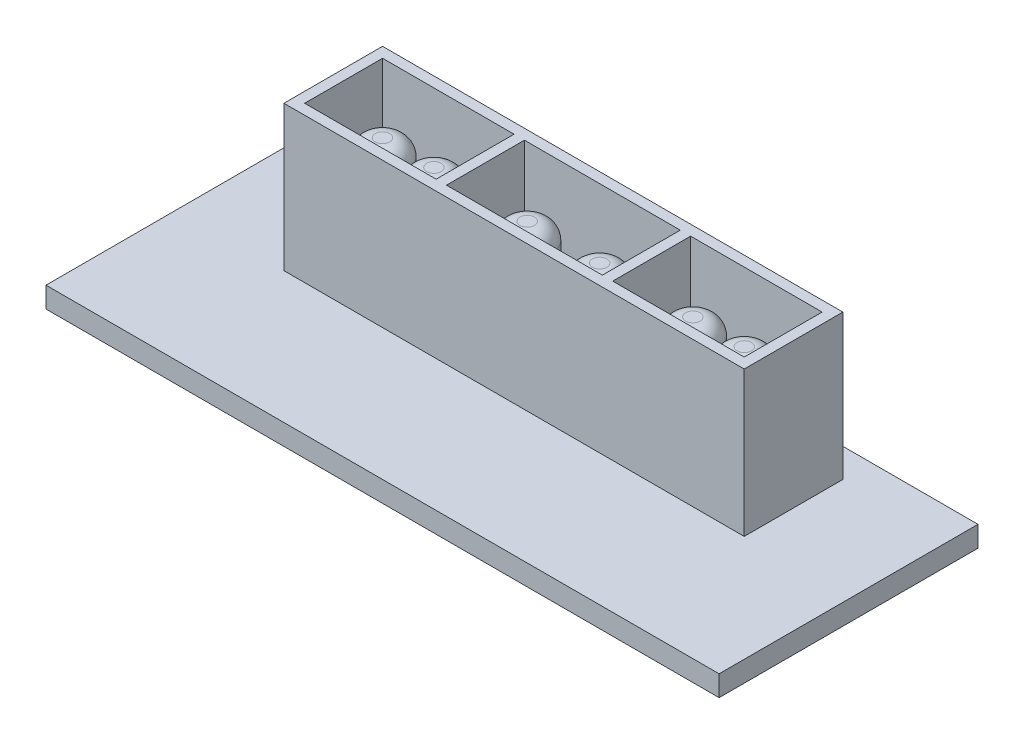
ISO-10303-21;
HEADER;
FILE_DESCRIPTION(('STEP AP214'),'2;1');
FILE_NAME('part.step','',(''),(''),'','','');
FILE_SCHEMA(('AUTOMOTIVE_DESIGN { 1 0 10303 214 1 1 1 1 }'));
ENDSEC;
DATA;
#1=APPLICATION_CONTEXT('core data for automotive mechanical design processes');
#2=APPLICATION_PROTOCOL_DEFINITION('international standard','automotive_design',2000,#1);
#3=PRODUCT_CONTEXT('',#1,'mechanical');
#4=PRODUCT('Part','Part','',(#3));
#5=PRODUCT_RELATED_PRODUCT_CATEGORY('part','',(#4));
#6=PRODUCT_DEFINITION_FORMATION('','',#4);
#7=PRODUCT_DEFINITION_CONTEXT('part definition',#1,'design');
#8=PRODUCT_DEFINITION('design','',#6,#7);
#9=PRODUCT_DEFINITION_SHAPE('','',#8);
#10=(LENGTH_UNIT() NAMED_UNIT(*) SI_UNIT(.MILLI.,.METRE.));
#11=(NAMED_UNIT(*) PLANE_ANGLE_UNIT() SI_UNIT($,.RADIAN.));
#12=(NAMED_UNIT(*) SI_UNIT($,.STERADIAN.) SOLID_ANGLE_UNIT());
#13=UNCERTAINTY_MEASURE_WITH_UNIT(LENGTH_MEASURE(1.E-05),#10,'distance_accuracy_value','');
#14=(GEOMETRIC_REPRESENTATION_CONTEXT(3) GLOBAL_UNCERTAINTY_ASSIGNED_CONTEXT((#13)) GLOBAL_UNIT_ASSIGNED_CONTEXT((#10,
#11,#12)) REPRESENTATION_CONTEXT('',''));
#15=CARTESIAN_POINT('',(0.,0.,0.));
#16=DIRECTION('',(0.,0.,1.));
#17=DIRECTION('',(1.,0.,0.));
#18=AXIS2_PLACEMENT_3D('',#15,#16,#17);
#19=CARTESIAN_POINT('',(0.,2.,0.));
#20=DIRECTION('',(0.,1.,0.));
#21=DIRECTION('',(0.,0.,1.));
#22=AXIS2_PLACEMENT_3D('',#19,#20,#21);
#23=PLANE('',#22);
#24=DIRECTION('',(0.,0.,-1.));
#25=VECTOR('',#24,1.);
#26=CARTESIAN_POINT('',(0.,2.,0.));
#27=LINE('',#26,#25);
#28=CARTESIAN_POINT('',(0.,2.,0.));
#29=VERTEX_POINT('',#28);
#30=CARTESIAN_POINT('',(0.,2.,-25.));
#31=VERTEX_POINT('',#30);
#32=EDGE_CURVE('E302',#29,#31,#27,.T.);
#33=ORIENTED_EDGE('',*,*,#32,.T.);
#34=DIRECTION('',(-1.,0.,0.));
#35=VECTOR('',#34,1.);
#36=CARTESIAN_POINT('',(0.,2.,-25.));
#37=LINE('',#36,#35);
#38=CARTESIAN_POINT('',(-65.,2.,-25.));
#39=VERTEX_POINT('',#38);
#40=EDGE_CURVE('E305',#31,#39,#37,.T.);
#41=ORIENTED_EDGE('',*,*,#40,.T.);
#42=DIRECTION('',(0.,0.,1.));
#43=VECTOR('',#42,1.);
#44=CARTESIAN_POINT('',(-65.,2.,0.));
#45=LINE('',#44,#43);
#46=CARTESIAN_POINT('',(-65.,2.,0.));
#47=VERTEX_POINT('',#46);
#48=EDGE_CURVE('E308',#39,#47,#45,.T.);
#49=ORIENTED_EDGE('',*,*,#48,.T.);
#50=DIRECTION('',(1.,0.,0.));
#51=VECTOR('',#50,1.);
#52=CARTESIAN_POINT('',(0.,2.,0.));
#53=LINE('',#52,#51);
#54=EDGE_CURVE('E310',#47,#29,#53,.T.);
#55=ORIENTED_EDGE('',*,*,#54,.T.);
#56=EDGE_LOOP('',(#33,#41,#49,#55));
#57=FACE_BOUND('',#56,.T.);
#58=DIRECTION('',(1.,0.,0.));
#59=VECTOR('',#58,1.);
#60=CARTESIAN_POINT('',(-54.725,2.,-12.7));
#61=LINE('',#60,#59);
#62=CARTESIAN_POINT('',(-54.725,2.,-12.7));
#63=VERTEX_POINT('',#62);
#64=CARTESIAN_POINT('',(-10.275,2.,-12.7));
#65=VERTEX_POINT('',#64);
#66=EDGE_CURVE('E288',#63,#65,#61,.T.);
#67=ORIENTED_EDGE('',*,*,#66,.F.);
#68=DIRECTION('',(0.,0.,1.));
#69=VECTOR('',#68,1.);
#70=CARTESIAN_POINT('',(-54.725,2.,-22.225));
#71=LINE('',#70,#69);
#72=CARTESIAN_POINT('',(-54.725,2.,-22.225));
#73=VERTEX_POINT('',#72);
#74=EDGE_CURVE('E274',#73,#63,#71,.T.);
#75=ORIENTED_EDGE('',*,*,#74,.F.);
#76=DIRECTION('',(-1.,0.,0.));
#77=VECTOR('',#76,1.);
#78=CARTESIAN_POINT('',(-54.725,2.,-22.225));
#79=LINE('',#78,#77);
#80=CARTESIAN_POINT('',(-10.275,2.,-22.225));
#81=VERTEX_POINT('',#80);
#82=EDGE_CURVE('E279',#81,#73,#79,.T.);
#83=ORIENTED_EDGE('',*,*,#82,.F.);
#84=DIRECTION('',(0.,0.,-1.));
#85=VECTOR('',#84,1.);
#86=CARTESIAN_POINT('',(-10.275,2.,-22.225));
#87=LINE('',#86,#85);
#88=EDGE_CURVE('E290',#65,#81,#87,.T.);
#89=ORIENTED_EDGE('',*,*,#88,.F.);
#90=EDGE_LOOP('',(#67,#75,#83,#89));
#91=FACE_BOUND('',#90,.T.);
#92=ADVANCED_FACE('F35',(#57,#91),#23,.T.);
#93=CARTESIAN_POINT('',(0.,2.,0.));
#94=DIRECTION('',(-1.,0.,0.));
#95=DIRECTION('',(0.,0.,1.));
#96=AXIS2_PLACEMENT_3D('',#93,#94,#95);
#97=PLANE('',#96);
#98=DIRECTION('',(0.,0.,-1.));
#99=VECTOR('',#98,1.);
#100=CARTESIAN_POINT('',(0.,0.,0.));
#101=LINE('',#100,#99);
#102=CARTESIAN_POINT('',(0.,0.,0.));
#103=VERTEX_POINT('',#102);
#104=CARTESIAN_POINT('',(0.,0.,-25.));
#105=VERTEX_POINT('',#104);
#106=EDGE_CURVE('E301',#103,#105,#101,.T.);
#107=ORIENTED_EDGE('',*,*,#106,.T.);
#108=DIRECTION('',(0.,-1.,0.));
#109=VECTOR('',#108,1.);
#110=CARTESIAN_POINT('',(0.,2.,-25.));
#111=LINE('',#110,#109);
#112=EDGE_CURVE('E328',#31,#105,#111,.T.);
#113=ORIENTED_EDGE('',*,*,#112,.F.);
#114=ORIENTED_EDGE('',*,*,#32,.F.);
#115=DIRECTION('',(0.,-1.,0.));
#116=VECTOR('',#115,1.);
#117=CARTESIAN_POINT('',(0.,2.,0.));
#118=LINE('',#117,#116);
#119=EDGE_CURVE('E312',#29,#103,#118,.T.);
#120=ORIENTED_EDGE('',*,*,#119,.T.);
#121=EDGE_LOOP('',(#107,#113,#114,#120));
#122=FACE_BOUND('',#121,.T.);
#123=ADVANCED_FACE('F375',(#122),#97,.F.);
#124=CARTESIAN_POINT('',(0.,2.,-25.));
#125=DIRECTION('',(0.,0.,1.));
#126=DIRECTION('',(1.,0.,0.));
#127=AXIS2_PLACEMENT_3D('',#124,#125,#126);
#128=PLANE('',#127);
#129=DIRECTION('',(-1.,0.,0.));
#130=VECTOR('',#129,1.);
#131=CARTESIAN_POINT('',(0.,0.,-25.));
#132=LINE('',#131,#130);
#133=CARTESIAN_POINT('',(-65.,0.,-25.));
#134=VERTEX_POINT('',#133);
#135=EDGE_CURVE('E315',#105,#134,#132,.T.);
#136=ORIENTED_EDGE('',*,*,#135,.T.);
#137=DIRECTION('',(0.,-1.,0.));
#138=VECTOR('',#137,1.);
#139=CARTESIAN_POINT('',(-65.,2.,-25.));
#140=LINE('',#139,#138);
#141=EDGE_CURVE('E325',#39,#134,#140,.T.);
#142=ORIENTED_EDGE('',*,*,#141,.F.);
#143=ORIENTED_EDGE('',*,*,#40,.F.);
#144=ORIENTED_EDGE('',*,*,#112,.T.);
#145=EDGE_LOOP('',(#136,#142,#143,#144));
#146=FACE_BOUND('',#145,.T.);
#147=ADVANCED_FACE('F383',(#146),#128,.F.);
#148=CARTESIAN_POINT('',(-65.,2.,0.));
#149=DIRECTION('',(1.,0.,0.));
#150=DIRECTION('',(0.,0.,-1.));
#151=AXIS2_PLACEMENT_3D('',#148,#149,#150);
#152=PLANE('',#151);
#153=DIRECTION('',(0.,0.,1.));
#154=VECTOR('',#153,1.);
#155=CARTESIAN_POINT('',(-65.,0.,0.));
#156=LINE('',#155,#154);
#157=CARTESIAN_POINT('',(-65.,0.,0.));
#158=VERTEX_POINT('',#157);
#159=EDGE_CURVE('E317',#134,#158,#156,.T.);
#160=ORIENTED_EDGE('',*,*,#159,.T.);
#161=DIRECTION('',(0.,-1.,0.));
#162=VECTOR('',#161,1.);
#163=CARTESIAN_POINT('',(-65.,2.,0.));
#164=LINE('',#163,#162);
#165=EDGE_CURVE('E322',#47,#158,#164,.T.);
#166=ORIENTED_EDGE('',*,*,#165,.F.);
#167=ORIENTED_EDGE('',*,*,#48,.F.);
#168=ORIENTED_EDGE('',*,*,#141,.T.);
#169=EDGE_LOOP('',(#160,#166,#167,#168));
#170=FACE_BOUND('',#169,.T.);
#171=ADVANCED_FACE('F807',(#170),#152,.F.);
#172=CARTESIAN_POINT('',(0.,2.,0.));
#173=DIRECTION('',(0.,0.,-1.));
#174=DIRECTION('',(-1.,0.,0.));
#175=AXIS2_PLACEMENT_3D('',#172,#173,#174);
#176=PLANE('',#175);
#177=DIRECTION('',(1.,0.,0.));
#178=VECTOR('',#177,1.);
#179=CARTESIAN_POINT('',(0.,0.,0.));
#180=LINE('',#179,#178);
#181=EDGE_CURVE('E306',#158,#103,#180,.T.);
#182=ORIENTED_EDGE('',*,*,#181,.T.);
#183=ORIENTED_EDGE('',*,*,#119,.F.);
#184=ORIENTED_EDGE('',*,*,#54,.F.);
#185=ORIENTED_EDGE('',*,*,#165,.T.);
#186=EDGE_LOOP('',(#182,#183,#184,#185));
#187=FACE_BOUND('',#186,.T.);
#188=ADVANCED_FACE('F811',(#187),#176,.F.);
#189=CARTESIAN_POINT('',(0.,0.,0.));
#190=DIRECTION('',(0.,1.,0.));
#191=DIRECTION('',(0.,0.,1.));
#192=AXIS2_PLACEMENT_3D('',#189,#190,#191);
#193=PLANE('',#192);
#194=ORIENTED_EDGE('',*,*,#106,.F.);
#195=ORIENTED_EDGE('',*,*,#181,.F.);
#196=ORIENTED_EDGE('',*,*,#159,.F.);
#197=ORIENTED_EDGE('',*,*,#135,.F.);
#198=EDGE_LOOP('',(#194,#195,#196,#197));
#199=FACE_BOUND('',#198,.T.);
#200=ADVANCED_FACE('F460',(#199),#193,.F.);
#201=CARTESIAN_POINT('',(0.,16.,0.));
#202=DIRECTION('',(0.,1.,0.));
#203=DIRECTION('',(0.,0.,1.));
#204=AXIS2_PLACEMENT_3D('',#201,#202,#203);
#205=PLANE('',#204);
#206=DIRECTION('',(0.,0.,1.));
#207=VECTOR('',#206,1.);
#208=CARTESIAN_POINT('',(-54.725,16.,-22.225));
#209=LINE('',#208,#207);
#210=CARTESIAN_POINT('',(-54.725,16.,-22.225));
#211=VERTEX_POINT('',#210);
#212=CARTESIAN_POINT('',(-54.725,16.,-12.7));
#213=VERTEX_POINT('',#212);
#214=EDGE_CURVE('E275',#211,#213,#209,.T.);
#215=ORIENTED_EDGE('',*,*,#214,.T.);
#216=DIRECTION('',(1.,0.,0.));
#217=VECTOR('',#216,1.);
#218=CARTESIAN_POINT('',(-54.725,16.,-12.7));
#219=LINE('',#218,#217);
#220=CARTESIAN_POINT('',(-10.275,16.,-12.7));
#221=VERTEX_POINT('',#220);
#222=EDGE_CURVE('E278',#213,#221,#219,.T.);
#223=ORIENTED_EDGE('',*,*,#222,.T.);
#224=DIRECTION('',(0.,0.,-1.));
#225=VECTOR('',#224,1.);
#226=CARTESIAN_POINT('',(-10.275,16.,-22.225));
#227=LINE('',#226,#225);
#228=CARTESIAN_POINT('',(-10.275,16.,-22.225));
#229=VERTEX_POINT('',#228);
#230=EDGE_CURVE('E281',#221,#229,#227,.T.);
#231=ORIENTED_EDGE('',*,*,#230,.T.);
#232=DIRECTION('',(-1.,0.,0.));
#233=VECTOR('',#232,1.);
#234=CARTESIAN_POINT('',(-54.725,16.,-22.225));
#235=LINE('',#234,#233);
#236=EDGE_CURVE('E283',#229,#211,#235,.T.);
#237=ORIENTED_EDGE('',*,*,#236,.T.);
#238=EDGE_LOOP('',(#215,#223,#231,#237));
#239=FACE_BOUND('',#238,.T.);
#240=DIRECTION('',(1.,0.,0.));
#241=VECTOR('',#240,1.);
#242=CARTESIAN_POINT('',(-53.725,16.,-13.7));
#243=LINE('',#242,#241);
#244=CARTESIAN_POINT('',(-53.725,16.,-13.7));
#245=VERTEX_POINT('',#244);
#246=CARTESIAN_POINT('',(-41.025,16.,-13.7));
#247=VERTEX_POINT('',#246);
#248=EDGE_CURVE('E248',#245,#247,#243,.T.);
#249=ORIENTED_EDGE('',*,*,#248,.F.);
#250=DIRECTION('',(0.,0.,1.));
#251=VECTOR('',#250,1.);
#252=CARTESIAN_POINT('',(-53.725,16.,-21.225));
#253=LINE('',#252,#251);
#254=CARTESIAN_POINT('',(-53.725,16.,-21.225));
#255=VERTEX_POINT('',#254);
#256=EDGE_CURVE('E246',#255,#245,#253,.T.);
#257=ORIENTED_EDGE('',*,*,#256,.F.);
#258=DIRECTION('',(-1.,0.,0.));
#259=VECTOR('',#258,1.);
#260=CARTESIAN_POINT('',(-53.725,16.,-21.225));
#261=LINE('',#260,#259);
#262=CARTESIAN_POINT('',(-41.025,16.,-21.225));
#263=VERTEX_POINT('',#262);
#264=EDGE_CURVE('E254',#263,#255,#261,.T.);
#265=ORIENTED_EDGE('',*,*,#264,.F.);
#266=DIRECTION('',(0.,0.,-1.));
#267=VECTOR('',#266,1.);
#268=CARTESIAN_POINT('',(-41.025,16.,-21.225));
#269=LINE('',#268,#267);
#270=EDGE_CURVE('E251',#247,#263,#269,.T.);
#271=ORIENTED_EDGE('',*,*,#270,.F.);
#272=EDGE_LOOP('',(#249,#257,#265,#271));
#273=FACE_BOUND('',#272,.T.);
#274=DIRECTION('',(0.,0.,1.));
#275=VECTOR('',#274,1.);
#276=CARTESIAN_POINT('',(-23.975,16.,-21.225));
#277=LINE('',#276,#275);
#278=CARTESIAN_POINT('',(-23.975,16.,-21.225));
#279=VERTEX_POINT('',#278);
#280=CARTESIAN_POINT('',(-23.975,16.,-13.7));
#281=VERTEX_POINT('',#280);
#282=EDGE_CURVE('E220',#279,#281,#277,.T.);
#283=ORIENTED_EDGE('',*,*,#282,.F.);
#284=DIRECTION('',(-1.,0.,0.));
#285=VECTOR('',#284,1.);
#286=CARTESIAN_POINT('',(-23.975,16.,-21.225));
#287=LINE('',#286,#285);
#288=CARTESIAN_POINT('',(-11.275,16.,-21.225));
#289=VERTEX_POINT('',#288);
#290=EDGE_CURVE('E218',#289,#279,#287,.T.);
#291=ORIENTED_EDGE('',*,*,#290,.F.);
#292=DIRECTION('',(0.,0.,-1.));
#293=VECTOR('',#292,1.);
#294=CARTESIAN_POINT('',(-11.275,16.,-21.225));
#295=LINE('',#294,#293);
#296=CARTESIAN_POINT('',(-11.275,16.,-13.7));
#297=VERTEX_POINT('',#296);
#298=EDGE_CURVE('E226',#297,#289,#295,.T.);
#299=ORIENTED_EDGE('',*,*,#298,.F.);
#300=DIRECTION('',(1.,0.,0.));
#301=VECTOR('',#300,1.);
#302=CARTESIAN_POINT('',(-23.975,16.,-13.7));
#303=LINE('',#302,#301);
#304=EDGE_CURVE('E223',#281,#297,#303,.T.);
#305=ORIENTED_EDGE('',*,*,#304,.F.);
#306=EDGE_LOOP('',(#283,#291,#299,#305));
#307=FACE_BOUND('',#306,.T.);
#308=DIRECTION('',(0.,0.,-1.));
#309=VECTOR('',#308,1.);
#310=CARTESIAN_POINT('',(-24.975000032,16.,-21.225));
#311=LINE('',#310,#309);
#312=CARTESIAN_POINT('',(-24.975000032,16.,-13.7));
#313=VERTEX_POINT('',#312);
#314=CARTESIAN_POINT('',(-24.975000032,16.,-21.225));
#315=VERTEX_POINT('',#314);
#316=EDGE_CURVE('E184',#313,#315,#311,.T.);
#317=ORIENTED_EDGE('',*,*,#316,.F.);
#318=DIRECTION('',(1.,0.,0.));
#319=VECTOR('',#318,1.);
#320=CARTESIAN_POINT('',(-40.024999968,16.,-13.7));
#321=LINE('',#320,#319);
#322=CARTESIAN_POINT('',(-40.024999968,16.,-13.7));
#323=VERTEX_POINT('',#322);
#324=EDGE_CURVE('E174',#323,#313,#321,.T.);
#325=ORIENTED_EDGE('',*,*,#324,.F.);
#326=DIRECTION('',(0.,0.,1.));
#327=VECTOR('',#326,1.);
#328=CARTESIAN_POINT('',(-40.024999968,16.,-21.225));
#329=LINE('',#328,#327);
#330=CARTESIAN_POINT('',(-40.024999968,16.,-21.225));
#331=VERTEX_POINT('',#330);
#332=EDGE_CURVE('E201',#331,#323,#329,.T.);
#333=ORIENTED_EDGE('',*,*,#332,.F.);
#334=DIRECTION('',(-1.,0.,0.));
#335=VECTOR('',#334,1.);
#336=CARTESIAN_POINT('',(-40.024999968,16.,-21.225));
#337=LINE('',#336,#335);
#338=EDGE_CURVE('E199',#315,#331,#337,.T.);
#339=ORIENTED_EDGE('',*,*,#338,.F.);
#340=EDGE_LOOP('',(#317,#325,#333,#339));
#341=FACE_BOUND('',#340,.T.);
#342=ADVANCED_FACE('F197',(#239,#273,#307,#341),#205,.T.);
#343=CARTESIAN_POINT('',(-54.725,16.,-22.225));
#344=DIRECTION('',(1.,0.,0.));
#345=DIRECTION('',(0.,0.,-1.));
#346=AXIS2_PLACEMENT_3D('',#343,#344,#345);
#347=PLANE('',#346);
#348=ORIENTED_EDGE('',*,*,#74,.T.);
#349=DIRECTION('',(0.,-1.,0.));
#350=VECTOR('',#349,1.);
#351=CARTESIAN_POINT('',(-54.725,16.,-12.7));
#352=LINE('',#351,#350);
#353=EDGE_CURVE('E299',#213,#63,#352,.T.);
#354=ORIENTED_EDGE('',*,*,#353,.F.);
#355=ORIENTED_EDGE('',*,*,#214,.F.);
#356=DIRECTION('',(0.,-1.,0.));
#357=VECTOR('',#356,1.);
#358=CARTESIAN_POINT('',(-54.725,16.,-22.225));
#359=LINE('',#358,#357);
#360=EDGE_CURVE('E285',#211,#73,#359,.T.);
#361=ORIENTED_EDGE('',*,*,#360,.T.);
#362=EDGE_LOOP('',(#348,#354,#355,#361));
#363=FACE_BOUND('',#362,.T.);
#364=ADVANCED_FACE('F459',(#363),#347,.F.);
#365=CARTESIAN_POINT('',(-54.725,16.,-12.7));
#366=DIRECTION('',(0.,0.,-1.));
#367=DIRECTION('',(-1.,0.,0.));
#368=AXIS2_PLACEMENT_3D('',#365,#366,#367);
#369=PLANE('',#368);
#370=ORIENTED_EDGE('',*,*,#66,.T.);
#371=DIRECTION('',(0.,-1.,0.));
#372=VECTOR('',#371,1.);
#373=CARTESIAN_POINT('',(-10.275,16.,-12.7));
#374=LINE('',#373,#372);
#375=EDGE_CURVE('E296',#221,#65,#374,.T.);
#376=ORIENTED_EDGE('',*,*,#375,.F.);
#377=ORIENTED_EDGE('',*,*,#222,.F.);
#378=ORIENTED_EDGE('',*,*,#353,.T.);
#379=EDGE_LOOP('',(#370,#376,#377,#378));
#380=FACE_BOUND('',#379,.T.);
#381=ADVANCED_FACE('F467',(#380),#369,.F.);
#382=CARTESIAN_POINT('',(-10.275,16.,-22.225));
#383=DIRECTION('',(-1.,0.,0.));
#384=DIRECTION('',(0.,0.,1.));
#385=AXIS2_PLACEMENT_3D('',#382,#383,#384);
#386=PLANE('',#385);
#387=ORIENTED_EDGE('',*,*,#88,.T.);
#388=DIRECTION('',(0.,-1.,0.));
#389=VECTOR('',#388,1.);
#390=CARTESIAN_POINT('',(-10.275,16.,-22.225));
#391=LINE('',#390,#389);
#392=EDGE_CURVE('E50',#229,#81,#391,.T.);
#393=ORIENTED_EDGE('',*,*,#392,.F.);
#394=ORIENTED_EDGE('',*,*,#230,.F.);
#395=ORIENTED_EDGE('',*,*,#375,.T.);
#396=EDGE_LOOP('',(#387,#393,#394,#395));
#397=FACE_BOUND('',#396,.T.);
#398=ADVANCED_FACE('F464',(#397),#386,.F.);
#399=CARTESIAN_POINT('',(-54.725,16.,-22.225));
#400=DIRECTION('',(0.,0.,1.));
#401=DIRECTION('',(1.,0.,0.));
#402=AXIS2_PLACEMENT_3D('',#399,#400,#401);
#403=PLANE('',#402);
#404=ORIENTED_EDGE('',*,*,#82,.T.);
#405=ORIENTED_EDGE('',*,*,#360,.F.);
#406=ORIENTED_EDGE('',*,*,#236,.F.);
#407=ORIENTED_EDGE('',*,*,#392,.T.);
#408=EDGE_LOOP('',(#404,#405,#406,#407));
#409=FACE_BOUND('',#408,.T.);
#410=ADVANCED_FACE('F455',(#409),#403,.F.);
#411=CARTESIAN_POINT('',(-53.725,16.,-21.225));
#412=DIRECTION('',(1.,0.,0.));
#413=DIRECTION('',(0.,0.,-1.));
#414=AXIS2_PLACEMENT_3D('',#411,#412,#413);
#415=PLANE('',#414);
#416=DIRECTION('',(0.,0.,1.));
#417=VECTOR('',#416,1.);
#418=CARTESIAN_POINT('',(-53.725,2.,-21.225));
#419=LINE('',#418,#417);
#420=CARTESIAN_POINT('',(-53.725,2.,-21.225));
#421=VERTEX_POINT('',#420);
#422=CARTESIAN_POINT('',(-53.725,2.,-13.7));
#423=VERTEX_POINT('',#422);
#424=EDGE_CURVE('E58',#421,#423,#419,.T.);
#425=ORIENTED_EDGE('',*,*,#424,.F.);
#426=DIRECTION('',(0.,-1.,0.));
#427=VECTOR('',#426,1.);
#428=CARTESIAN_POINT('',(-53.725,16.,-21.225));
#429=LINE('',#428,#427);
#430=EDGE_CURVE('E256',#255,#421,#429,.T.);
#431=ORIENTED_EDGE('',*,*,#430,.F.);
#432=ORIENTED_EDGE('',*,*,#256,.T.);
#433=DIRECTION('',(0.,-1.,0.));
#434=VECTOR('',#433,1.);
#435=CARTESIAN_POINT('',(-53.725,16.,-13.7));
#436=LINE('',#435,#434);
#437=EDGE_CURVE('E271',#245,#423,#436,.T.);
#438=ORIENTED_EDGE('',*,*,#437,.T.);
#439=EDGE_LOOP('',(#425,#431,#432,#438));
#440=FACE_BOUND('',#439,.T.);
#441=ADVANCED_FACE('F451',(#440),#415,.T.);
#442=CARTESIAN_POINT('',(-53.725,16.,-13.7));
#443=DIRECTION('',(0.,0.,-1.));
#444=DIRECTION('',(-1.,0.,0.));
#445=AXIS2_PLACEMENT_3D('',#442,#443,#444);
#446=PLANE('',#445);
#447=DIRECTION('',(1.,0.,0.));
#448=VECTOR('',#447,1.);
#449=CARTESIAN_POINT('',(-53.725,2.,-13.7));
#450=LINE('',#449,#448);
#451=CARTESIAN_POINT('',(-41.025,2.,-13.7));
#452=VERTEX_POINT('',#451);
#453=EDGE_CURVE('E258',#423,#452,#450,.T.);
#454=ORIENTED_EDGE('',*,*,#453,.F.);
#455=ORIENTED_EDGE('',*,*,#437,.F.);
#456=ORIENTED_EDGE('',*,*,#248,.T.);
#457=DIRECTION('',(0.,-1.,0.));
#458=VECTOR('',#457,1.);
#459=CARTESIAN_POINT('',(-41.025,16.,-13.7));
#460=LINE('',#459,#458);
#461=EDGE_CURVE('E268',#247,#452,#460,.T.);
#462=ORIENTED_EDGE('',*,*,#461,.T.);
#463=EDGE_LOOP('',(#454,#455,#456,#462));
#464=FACE_BOUND('',#463,.T.);
#465=ADVANCED_FACE('F447',(#464),#446,.T.);
#466=CARTESIAN_POINT('',(-41.025,16.,-21.225));
#467=DIRECTION('',(-1.,0.,0.));
#468=DIRECTION('',(0.,0.,1.));
#469=AXIS2_PLACEMENT_3D('',#466,#467,#468);
#470=PLANE('',#469);
#471=DIRECTION('',(0.,0.,-1.));
#472=VECTOR('',#471,1.);
#473=CARTESIAN_POINT('',(-41.025,2.,-21.225));
#474=LINE('',#473,#472);
#475=CARTESIAN_POINT('',(-41.025,2.,-21.225));
#476=VERTEX_POINT('',#475);
#477=EDGE_CURVE('E260',#452,#476,#474,.T.);
#478=ORIENTED_EDGE('',*,*,#477,.F.);
#479=ORIENTED_EDGE('',*,*,#461,.F.);
#480=ORIENTED_EDGE('',*,*,#270,.T.);
#481=DIRECTION('',(0.,-1.,0.));
#482=VECTOR('',#481,1.);
#483=CARTESIAN_POINT('',(-41.025,16.,-21.225));
#484=LINE('',#483,#482);
#485=EDGE_CURVE('E265',#263,#476,#484,.T.);
#486=ORIENTED_EDGE('',*,*,#485,.T.);
#487=EDGE_LOOP('',(#478,#479,#480,#486));
#488=FACE_BOUND('',#487,.T.);
#489=ADVANCED_FACE('F443',(#488),#470,.T.);
#490=CARTESIAN_POINT('',(-53.725,16.,-21.225));
#491=DIRECTION('',(0.,0.,1.));
#492=DIRECTION('',(1.,0.,0.));
#493=AXIS2_PLACEMENT_3D('',#490,#491,#492);
#494=PLANE('',#493);
#495=DIRECTION('',(-1.,0.,0.));
#496=VECTOR('',#495,1.);
#497=CARTESIAN_POINT('',(-53.725,2.,-21.225));
#498=LINE('',#497,#496);
#499=EDGE_CURVE('E249',#476,#421,#498,.T.);
#500=ORIENTED_EDGE('',*,*,#499,.F.);
#501=ORIENTED_EDGE('',*,*,#485,.F.);
#502=ORIENTED_EDGE('',*,*,#264,.T.);
#503=ORIENTED_EDGE('',*,*,#430,.T.);
#504=EDGE_LOOP('',(#500,#501,#502,#503));
#505=FACE_BOUND('',#504,.T.);
#506=ADVANCED_FACE('F439',(#505),#494,.T.);
#507=CARTESIAN_POINT('',(-23.975,16.,-21.225));
#508=DIRECTION('',(0.,0.,1.));
#509=DIRECTION('',(1.,0.,0.));
#510=AXIS2_PLACEMENT_3D('',#507,#508,#509);
#511=PLANE('',#510);
#512=DIRECTION('',(-1.,0.,0.));
#513=VECTOR('',#512,1.);
#514=CARTESIAN_POINT('',(-23.975,2.,-21.225));
#515=LINE('',#514,#513);
#516=CARTESIAN_POINT('',(-11.275,2.,-21.225));
#517=VERTEX_POINT('',#516);
#518=CARTESIAN_POINT('',(-23.975,2.,-21.225));
#519=VERTEX_POINT('',#518);
#520=EDGE_CURVE('E193',#517,#519,#515,.T.);
#521=ORIENTED_EDGE('',*,*,#520,.F.);
#522=DIRECTION('',(0.,-1.,0.));
#523=VECTOR('',#522,1.);
#524=CARTESIAN_POINT('',(-11.275,16.,-21.225));
#525=LINE('',#524,#523);
#526=EDGE_CURVE('E228',#289,#517,#525,.T.);
#527=ORIENTED_EDGE('',*,*,#526,.F.);
#528=ORIENTED_EDGE('',*,*,#290,.T.);
#529=DIRECTION('',(0.,-1.,0.));
#530=VECTOR('',#529,1.);
#531=CARTESIAN_POINT('',(-23.975,16.,-21.225));
#532=LINE('',#531,#530);
#533=EDGE_CURVE('E243',#279,#519,#532,.T.);
#534=ORIENTED_EDGE('',*,*,#533,.T.);
#535=EDGE_LOOP('',(#521,#527,#528,#534));
#536=FACE_BOUND('',#535,.T.);
#537=ADVANCED_FACE('F435',(#536),#511,.T.);
#538=CARTESIAN_POINT('',(-23.975,16.,-21.225));
#539=DIRECTION('',(1.,0.,0.));
#540=DIRECTION('',(0.,0.,-1.));
#541=AXIS2_PLACEMENT_3D('',#538,#539,#540);
#542=PLANE('',#541);
#543=DIRECTION('',(0.,0.,1.));
#544=VECTOR('',#543,1.);
#545=CARTESIAN_POINT('',(-23.975,2.,-21.225));
#546=LINE('',#545,#544);
#547=CARTESIAN_POINT('',(-23.975,2.,-13.7));
#548=VERTEX_POINT('',#547);
#549=EDGE_CURVE('E230',#519,#548,#546,.T.);
#550=ORIENTED_EDGE('',*,*,#549,.F.);
#551=ORIENTED_EDGE('',*,*,#533,.F.);
#552=ORIENTED_EDGE('',*,*,#282,.T.);
#553=DIRECTION('',(0.,-1.,0.));
#554=VECTOR('',#553,1.);
#555=CARTESIAN_POINT('',(-23.975,16.,-13.7));
#556=LINE('',#555,#554);
#557=EDGE_CURVE('E240',#281,#548,#556,.T.);
#558=ORIENTED_EDGE('',*,*,#557,.T.);
#559=EDGE_LOOP('',(#550,#551,#552,#558));
#560=FACE_BOUND('',#559,.T.);
#561=ADVANCED_FACE('F431',(#560),#542,.T.);
#562=CARTESIAN_POINT('',(-23.975,16.,-13.7));
#563=DIRECTION('',(0.,0.,-1.));
#564=DIRECTION('',(-1.,0.,0.));
#565=AXIS2_PLACEMENT_3D('',#562,#563,#564);
#566=PLANE('',#565);
#567=DIRECTION('',(1.,0.,0.));
#568=VECTOR('',#567,1.);
#569=CARTESIAN_POINT('',(-23.975,2.,-13.7));
#570=LINE('',#569,#568);
#571=CARTESIAN_POINT('',(-11.275,2.,-13.7));
#572=VERTEX_POINT('',#571);
#573=EDGE_CURVE('E232',#548,#572,#570,.T.);
#574=ORIENTED_EDGE('',*,*,#573,.F.);
#575=ORIENTED_EDGE('',*,*,#557,.F.);
#576=ORIENTED_EDGE('',*,*,#304,.T.);
#577=DIRECTION('',(0.,-1.,0.));
#578=VECTOR('',#577,1.);
#579=CARTESIAN_POINT('',(-11.275,16.,-13.7));
#580=LINE('',#579,#578);
#581=EDGE_CURVE('E237',#297,#572,#580,.T.);
#582=ORIENTED_EDGE('',*,*,#581,.T.);
#583=EDGE_LOOP('',(#574,#575,#576,#582));
#584=FACE_BOUND('',#583,.T.);
#585=ADVANCED_FACE('F427',(#584),#566,.T.);
#586=CARTESIAN_POINT('',(-11.275,16.,-21.225));
#587=DIRECTION('',(-1.,0.,0.));
#588=DIRECTION('',(0.,0.,1.));
#589=AXIS2_PLACEMENT_3D('',#586,#587,#588);
#590=PLANE('',#589);
#591=DIRECTION('',(0.,0.,-1.));
#592=VECTOR('',#591,1.);
#593=CARTESIAN_POINT('',(-11.275,2.,-21.225));
#594=LINE('',#593,#592);
#595=EDGE_CURVE('E221',#572,#517,#594,.T.);
#596=ORIENTED_EDGE('',*,*,#595,.F.);
#597=ORIENTED_EDGE('',*,*,#581,.F.);
#598=ORIENTED_EDGE('',*,*,#298,.T.);
#599=ORIENTED_EDGE('',*,*,#526,.T.);
#600=EDGE_LOOP('',(#596,#597,#598,#599));
#601=FACE_BOUND('',#600,.T.);
#602=ADVANCED_FACE('F424',(#601),#590,.T.);
#603=CARTESIAN_POINT('',(-40.024999968,16.,-13.7));
#604=DIRECTION('',(0.,0.,-1.));
#605=DIRECTION('',(-1.,0.,0.));
#606=AXIS2_PLACEMENT_3D('',#603,#604,#605);
#607=PLANE('',#606);
#608=DIRECTION('',(1.,0.,0.));
#609=VECTOR('',#608,1.);
#610=CARTESIAN_POINT('',(-40.024999968,2.,-13.7));
#611=LINE('',#610,#609);
#612=CARTESIAN_POINT('',(-40.024999968,2.,-13.7));
#613=VERTEX_POINT('',#612);
#614=CARTESIAN_POINT('',(-24.975000032,2.,-13.7));
#615=VERTEX_POINT('',#614);
#616=EDGE_CURVE('E206',#613,#615,#611,.T.);
#617=ORIENTED_EDGE('',*,*,#616,.F.);
#618=DIRECTION('',(0.,-1.,0.));
#619=VECTOR('',#618,1.);
#620=CARTESIAN_POINT('',(-40.024999968,16.,-13.7));
#621=LINE('',#620,#619);
#622=EDGE_CURVE('E180',#323,#613,#621,.T.);
#623=ORIENTED_EDGE('',*,*,#622,.F.);
#624=ORIENTED_EDGE('',*,*,#324,.T.);
#625=DIRECTION('',(0.,-1.,0.));
#626=VECTOR('',#625,1.);
#627=CARTESIAN_POINT('',(-24.975000032,16.,-13.7));
#628=LINE('',#627,#626);
#629=EDGE_CURVE('E178',#313,#615,#628,.T.);
#630=ORIENTED_EDGE('',*,*,#629,.T.);
#631=EDGE_LOOP('',(#617,#623,#624,#630));
#632=FACE_BOUND('',#631,.T.);
#633=ADVANCED_FACE('F177',(#632),#607,.T.);
#634=CARTESIAN_POINT('',(-24.975000032,16.,-21.225));
#635=DIRECTION('',(-1.,0.,0.));
#636=DIRECTION('',(0.,0.,1.));
#637=AXIS2_PLACEMENT_3D('',#634,#635,#636);
#638=PLANE('',#637);
#639=DIRECTION('',(0.,0.,-1.));
#640=VECTOR('',#639,1.);
#641=CARTESIAN_POINT('',(-24.975000032,2.,-21.225));
#642=LINE('',#641,#640);
#643=CARTESIAN_POINT('',(-24.975000032,2.,-21.225));
#644=VERTEX_POINT('',#643);
#645=EDGE_CURVE('E192',#615,#644,#642,.T.);
#646=ORIENTED_EDGE('',*,*,#645,.F.);
#647=ORIENTED_EDGE('',*,*,#629,.F.);
#648=ORIENTED_EDGE('',*,*,#316,.T.);
#649=DIRECTION('',(0.,-1.,0.));
#650=VECTOR('',#649,1.);
#651=CARTESIAN_POINT('',(-24.975000032,16.,-21.225));
#652=LINE('',#651,#650);
#653=EDGE_CURVE('E194',#315,#644,#652,.T.);
#654=ORIENTED_EDGE('',*,*,#653,.T.);
#655=EDGE_LOOP('',(#646,#647,#648,#654));
#656=FACE_BOUND('',#655,.T.);
#657=ADVANCED_FACE('F189',(#656),#638,.T.);
#658=CARTESIAN_POINT('',(-40.024999968,16.,-21.225));
#659=DIRECTION('',(0.,0.,1.));
#660=DIRECTION('',(1.,0.,0.));
#661=AXIS2_PLACEMENT_3D('',#658,#659,#660);
#662=PLANE('',#661);
#663=DIRECTION('',(-1.,0.,0.));
#664=VECTOR('',#663,1.);
#665=CARTESIAN_POINT('',(-40.024999968,2.,-21.225));
#666=LINE('',#665,#664);
#667=CARTESIAN_POINT('',(-40.024999968,2.,-21.225));
#668=VERTEX_POINT('',#667);
#669=EDGE_CURVE('E210',#644,#668,#666,.T.);
#670=ORIENTED_EDGE('',*,*,#669,.F.);
#671=ORIENTED_EDGE('',*,*,#653,.F.);
#672=ORIENTED_EDGE('',*,*,#338,.T.);
#673=DIRECTION('',(0.,-1.,0.));
#674=VECTOR('',#673,1.);
#675=CARTESIAN_POINT('',(-40.024999968,16.,-21.225));
#676=LINE('',#675,#674);
#677=EDGE_CURVE('E214',#331,#668,#676,.T.);
#678=ORIENTED_EDGE('',*,*,#677,.T.);
#679=EDGE_LOOP('',(#670,#671,#672,#678));
#680=FACE_BOUND('',#679,.T.);
#681=ADVANCED_FACE('F401',(#680),#662,.T.);
#682=CARTESIAN_POINT('',(-40.024999968,16.,-21.225));
#683=DIRECTION('',(1.,0.,0.));
#684=DIRECTION('',(0.,0.,-1.));
#685=AXIS2_PLACEMENT_3D('',#682,#683,#684);
#686=PLANE('',#685);
#687=DIRECTION('',(0.,0.,1.));
#688=VECTOR('',#687,1.);
#689=CARTESIAN_POINT('',(-40.024999968,2.,-21.225));
#690=LINE('',#689,#688);
#691=EDGE_CURVE('E185',#668,#613,#690,.T.);
#692=ORIENTED_EDGE('',*,*,#691,.F.);
#693=ORIENTED_EDGE('',*,*,#677,.F.);
#694=ORIENTED_EDGE('',*,*,#332,.T.);
#695=ORIENTED_EDGE('',*,*,#622,.T.);
#696=EDGE_LOOP('',(#692,#693,#694,#695));
#697=FACE_BOUND('',#696,.T.);
#698=ADVANCED_FACE('F394',(#697),#686,.T.);
#699=CARTESIAN_POINT('',(-29.,2.,-17.4625));
#700=DIRECTION('',(0.,1.,0.));
#701=DIRECTION('',(0.,0.,-1.));
#702=AXIS2_PLACEMENT_3D('',#699,#700,#701);
#703=CIRCLE('',#702,2.299999953);
#704=CARTESIAN_POINT('',(-29.,2.,-19.762499953));
#705=VERTEX_POINT('',#704);
#706=EDGE_CURVE('E407',#705,#705,#703,.T.);
#707=ORIENTED_EDGE('',*,*,#706,.F.);
#708=EDGE_LOOP('',(#707));
#709=FACE_BOUND('',#708,.T.);
#710=CARTESIAN_POINT('',(-36.,2.,-17.4625));
#711=DIRECTION('',(0.,1.,0.));
#712=DIRECTION('',(0.,0.,1.));
#713=AXIS2_PLACEMENT_3D('',#710,#711,#712);
#714=CIRCLE('',#713,2.29999995300001);
#715=CARTESIAN_POINT('',(-36.,2.,-15.162500047));
#716=VERTEX_POINT('',#715);
#717=EDGE_CURVE('E208',#716,#716,#714,.T.);
#718=ORIENTED_EDGE('',*,*,#717,.F.);
#719=EDGE_LOOP('',(#718));
#720=FACE_BOUND('',#719,.T.);
#721=ORIENTED_EDGE('',*,*,#616,.T.);
#722=ORIENTED_EDGE('',*,*,#645,.T.);
#723=ORIENTED_EDGE('',*,*,#669,.T.);
#724=ORIENTED_EDGE('',*,*,#691,.T.);
#725=EDGE_LOOP('',(#721,#722,#723,#724));
#726=FACE_BOUND('',#725,.T.);
#727=ADVANCED_FACE('F379',(#709,#720,#726),#23,.T.);
#728=CARTESIAN_POINT('',(-15.03,2.,-17.4625));
#729=DIRECTION('',(0.,1.,0.));
#730=DIRECTION('',(0.,0.,-1.));
#731=AXIS2_PLACEMENT_3D('',#728,#729,#730);
#732=CIRCLE('',#731,2.299999953);
#733=CARTESIAN_POINT('',(-15.03,2.,-19.762499953));
#734=VERTEX_POINT('',#733);
#735=EDGE_CURVE('E897',#734,#734,#732,.T.);
#736=ORIENTED_EDGE('',*,*,#735,.F.);
#737=EDGE_LOOP('',(#736));
#738=FACE_BOUND('',#737,.T.);
#739=CARTESIAN_POINT('',(-19.998,2.,-17.4625));
#740=DIRECTION('',(0.,1.,0.));
#741=DIRECTION('',(0.,0.,1.));
#742=AXIS2_PLACEMENT_3D('',#739,#740,#741);
#743=CIRCLE('',#742,2.299999953);
#744=CARTESIAN_POINT('',(-19.998,2.,-15.162500047));
#745=VERTEX_POINT('',#744);
#746=EDGE_CURVE('E891',#745,#745,#743,.T.);
#747=ORIENTED_EDGE('',*,*,#746,.F.);
#748=EDGE_LOOP('',(#747));
#749=FACE_BOUND('',#748,.T.);
#750=ORIENTED_EDGE('',*,*,#520,.T.);
#751=ORIENTED_EDGE('',*,*,#549,.T.);
#752=ORIENTED_EDGE('',*,*,#573,.T.);
#753=ORIENTED_EDGE('',*,*,#595,.T.);
#754=EDGE_LOOP('',(#750,#751,#752,#753));
#755=FACE_BOUND('',#754,.T.);
#756=ADVANCED_FACE('F391',(#738,#749,#755),#23,.T.);
#757=CARTESIAN_POINT('',(-45.002,2.,-17.4624999999999));
#758=DIRECTION('',(0.,1.,0.));
#759=DIRECTION('',(0.,0.,-1.));
#760=AXIS2_PLACEMENT_3D('',#757,#758,#759);
#761=CIRCLE('',#760,2.29999995300001);
#762=CARTESIAN_POINT('',(-45.002,2.,-19.7624999529999));
#763=VERTEX_POINT('',#762);
#764=EDGE_CURVE('E900',#763,#763,#761,.T.);
#765=ORIENTED_EDGE('',*,*,#764,.F.);
#766=EDGE_LOOP('',(#765));
#767=FACE_BOUND('',#766,.T.);
#768=CARTESIAN_POINT('',(-49.97,2.,-17.4624999999999));
#769=DIRECTION('',(0.,1.,0.));
#770=DIRECTION('',(0.,0.,1.));
#771=AXIS2_PLACEMENT_3D('',#768,#769,#770);
#772=CIRCLE('',#771,2.299999953);
#773=CARTESIAN_POINT('',(-49.97,2.,-15.1625000469999));
#774=VERTEX_POINT('',#773);
#775=EDGE_CURVE('E889',#774,#774,#772,.T.);
#776=ORIENTED_EDGE('',*,*,#775,.F.);
#777=EDGE_LOOP('',(#776));
#778=FACE_BOUND('',#777,.T.);
#779=ORIENTED_EDGE('',*,*,#424,.T.);
#780=ORIENTED_EDGE('',*,*,#453,.T.);
#781=ORIENTED_EDGE('',*,*,#477,.T.);
#782=ORIENTED_EDGE('',*,*,#499,.T.);
#783=EDGE_LOOP('',(#779,#780,#781,#782));
#784=FACE_BOUND('',#783,.T.);
#785=ADVANCED_FACE('F378',(#767,#778,#784),#23,.T.);
#786=CARTESIAN_POINT('',(-36.,13.1125,-17.4625));
#787=DIRECTION('',(0.,-1.,0.));
#788=DIRECTION('',(0.,0.,-1.));
#789=AXIS2_PLACEMENT_3D('',#786,#787,#788);
#790=CYLINDRICAL_SURFACE('',#789,2.29999995300001);
#791=CARTESIAN_POINT('',(-36.,11.5125,-17.4625));
#792=DIRECTION('',(0.,1.,0.));
#793=DIRECTION('',(0.,0.,1.));
#794=AXIS2_PLACEMENT_3D('',#791,#792,#793);
#795=CIRCLE('',#794,2.29999995300001);
#796=CARTESIAN_POINT('',(-36.,11.5125,-15.162500047));
#797=VERTEX_POINT('',#796);
#798=EDGE_CURVE('E352',#797,#797,#795,.F.);
#799=ORIENTED_EDGE('',*,*,#798,.T.);
#800=EDGE_LOOP('',(#799));
#801=FACE_BOUND('',#800,.T.);
#802=ORIENTED_EDGE('',*,*,#717,.T.);
#803=EDGE_LOOP('',(#802));
#804=FACE_BOUND('',#803,.T.);
#805=ADVANCED_FACE('F390',(#801,#804),#790,.T.);
#806=CARTESIAN_POINT('',(-36.,13.1125,-17.4625));
#807=DIRECTION('',(0.,1.,0.));
#808=DIRECTION('',(0.,0.,1.));
#809=AXIS2_PLACEMENT_3D('',#806,#807,#808);
#810=PLANE('',#809);
#811=CARTESIAN_POINT('',(-36.,13.1125,-17.4625));
#812=DIRECTION('',(0.,1.,0.));
#813=DIRECTION('',(0.,0.,1.));
#814=AXIS2_PLACEMENT_3D('',#811,#812,#813);
#815=CIRCLE('',#814,0.699999953000005);
#816=CARTESIAN_POINT('',(-36.,13.1125,-16.762500047));
#817=VERTEX_POINT('',#816);
#818=EDGE_CURVE('E349',#817,#817,#815,.T.);
#819=ORIENTED_EDGE('',*,*,#818,.T.);
#820=EDGE_LOOP('',(#819));
#821=FACE_BOUND('',#820,.T.);
#822=ADVANCED_FACE('F606',(#821),#810,.T.);
#823=CARTESIAN_POINT('',(-49.97,13.1125,-17.4624999999999));
#824=DIRECTION('',(0.,-1.,0.));
#825=DIRECTION('',(0.,0.,-1.));
#826=AXIS2_PLACEMENT_3D('',#823,#824,#825);
#827=CYLINDRICAL_SURFACE('',#826,2.299999953);
#828=CARTESIAN_POINT('',(-49.97,11.5125,-17.4624999999999));
#829=DIRECTION('',(0.,1.,0.));
#830=DIRECTION('',(0.,0.,1.));
#831=AXIS2_PLACEMENT_3D('',#828,#829,#830);
#832=CIRCLE('',#831,2.299999953);
#833=CARTESIAN_POINT('',(-49.97,11.5125,-15.1625000469999));
#834=VERTEX_POINT('',#833);
#835=EDGE_CURVE('E11',#834,#834,#832,.F.);
#836=ORIENTED_EDGE('',*,*,#835,.T.);
#837=EDGE_LOOP('',(#836));
#838=FACE_BOUND('',#837,.T.);
#839=ORIENTED_EDGE('',*,*,#775,.T.);
#840=EDGE_LOOP('',(#839));
#841=FACE_BOUND('',#840,.T.);
#842=ADVANCED_FACE('F616',(#838,#841),#827,.T.);
#843=CARTESIAN_POINT('',(-49.97,13.1125,-17.4624999999999));
#844=DIRECTION('',(0.,1.,0.));
#845=DIRECTION('',(0.,0.,1.));
#846=AXIS2_PLACEMENT_3D('',#843,#844,#845);
#847=PLANE('',#846);
#848=CARTESIAN_POINT('',(-49.97,13.1125,-17.4624999999999));
#849=DIRECTION('',(0.,1.,0.));
#850=DIRECTION('',(0.,0.,1.));
#851=AXIS2_PLACEMENT_3D('',#848,#849,#850);
#852=CIRCLE('',#851,0.699999952999999);
#853=CARTESIAN_POINT('',(-49.97,13.1125,-16.7625000469999));
#854=VERTEX_POINT('',#853);
#855=EDGE_CURVE('E43',#854,#854,#852,.T.);
#856=ORIENTED_EDGE('',*,*,#855,.T.);
#857=EDGE_LOOP('',(#856));
#858=FACE_BOUND('',#857,.T.);
#859=ADVANCED_FACE('F363',(#858),#847,.T.);
#860=CARTESIAN_POINT('',(-19.998,13.1125,-17.4625));
#861=DIRECTION('',(0.,-1.,0.));
#862=DIRECTION('',(0.,0.,-1.));
#863=AXIS2_PLACEMENT_3D('',#860,#861,#862);
#864=CYLINDRICAL_SURFACE('',#863,2.299999953);
#865=CARTESIAN_POINT('',(-19.998,11.5125,-17.4625));
#866=DIRECTION('',(0.,1.,0.));
#867=DIRECTION('',(0.,0.,1.));
#868=AXIS2_PLACEMENT_3D('',#865,#866,#867);
#869=CIRCLE('',#868,2.299999953);
#870=CARTESIAN_POINT('',(-19.998,11.5125,-15.162500047));
#871=VERTEX_POINT('',#870);
#872=EDGE_CURVE('E340',#871,#871,#869,.F.);
#873=ORIENTED_EDGE('',*,*,#872,.T.);
#874=EDGE_LOOP('',(#873));
#875=FACE_BOUND('',#874,.T.);
#876=ORIENTED_EDGE('',*,*,#746,.T.);
#877=EDGE_LOOP('',(#876));
#878=FACE_BOUND('',#877,.T.);
#879=ADVANCED_FACE('F637',(#875,#878),#864,.T.);
#880=CARTESIAN_POINT('',(-19.998,13.1125,-17.4625));
#881=DIRECTION('',(0.,1.,0.));
#882=DIRECTION('',(0.,0.,1.));
#883=AXIS2_PLACEMENT_3D('',#880,#881,#882);
#884=PLANE('',#883);
#885=CARTESIAN_POINT('',(-19.998,13.1125,-17.4625));
#886=DIRECTION('',(0.,1.,0.));
#887=DIRECTION('',(0.,0.,1.));
#888=AXIS2_PLACEMENT_3D('',#885,#886,#887);
#889=CIRCLE('',#888,0.699999952999999);
#890=CARTESIAN_POINT('',(-19.998,13.1125,-16.762500047));
#891=VERTEX_POINT('',#890);
#892=EDGE_CURVE('E337',#891,#891,#889,.T.);
#893=ORIENTED_EDGE('',*,*,#892,.T.);
#894=EDGE_LOOP('',(#893));
#895=FACE_BOUND('',#894,.T.);
#896=ADVANCED_FACE('F647',(#895),#884,.T.);
#897=CARTESIAN_POINT('',(-29.,13.1125,-17.4625));
#898=DIRECTION('',(0.,-1.,0.));
#899=DIRECTION('',(0.,0.,-1.));
#900=AXIS2_PLACEMENT_3D('',#897,#898,#899);
#901=CYLINDRICAL_SURFACE('',#900,2.299999953);
#902=CARTESIAN_POINT('',(-29.,11.5125,-17.4625));
#903=DIRECTION('',(0.,-1.,0.));
#904=DIRECTION('',(0.,0.,-1.));
#905=AXIS2_PLACEMENT_3D('',#902,#903,#904);
#906=CIRCLE('',#905,2.299999953);
#907=CARTESIAN_POINT('',(-29.,11.5125,-19.762499953));
#908=VERTEX_POINT('',#907);
#909=EDGE_CURVE('E346',#908,#908,#906,.T.);
#910=ORIENTED_EDGE('',*,*,#909,.T.);
#911=EDGE_LOOP('',(#910));
#912=FACE_BOUND('',#911,.T.);
#913=ORIENTED_EDGE('',*,*,#706,.T.);
#914=EDGE_LOOP('',(#913));
#915=FACE_BOUND('',#914,.T.);
#916=ADVANCED_FACE('F658',(#912,#915),#901,.T.);
#917=CARTESIAN_POINT('',(-29.,13.1125,-17.4625));
#918=DIRECTION('',(0.,-1.,0.));
#919=DIRECTION('',(0.,0.,-1.));
#920=AXIS2_PLACEMENT_3D('',#917,#918,#919);
#921=PLANE('',#920);
#922=CARTESIAN_POINT('',(-29.,13.1125,-17.4625));
#923=DIRECTION('',(0.,-1.,0.));
#924=DIRECTION('',(0.,0.,-1.));
#925=AXIS2_PLACEMENT_3D('',#922,#923,#924);
#926=CIRCLE('',#925,0.699999952999999);
#927=CARTESIAN_POINT('',(-29.,13.1125,-18.162499953));
#928=VERTEX_POINT('',#927);
#929=EDGE_CURVE('E343',#928,#928,#926,.F.);
#930=ORIENTED_EDGE('',*,*,#929,.T.);
#931=EDGE_LOOP('',(#930));
#932=FACE_BOUND('',#931,.T.);
#933=ADVANCED_FACE('F669',(#932),#921,.F.);
#934=CARTESIAN_POINT('',(-15.03,13.1125,-17.4625));
#935=DIRECTION('',(0.,-1.,0.));
#936=DIRECTION('',(0.,0.,-1.));
#937=AXIS2_PLACEMENT_3D('',#934,#935,#936);
#938=CYLINDRICAL_SURFACE('',#937,2.299999953);
#939=CARTESIAN_POINT('',(-15.03,11.5125,-17.4625));
#940=DIRECTION('',(0.,-1.,0.));
#941=DIRECTION('',(0.,0.,-1.));
#942=AXIS2_PLACEMENT_3D('',#939,#940,#941);
#943=CIRCLE('',#942,2.299999953);
#944=CARTESIAN_POINT('',(-15.03,11.5125,-19.762499953));
#945=VERTEX_POINT('',#944);
#946=EDGE_CURVE('E334',#945,#945,#943,.T.);
#947=ORIENTED_EDGE('',*,*,#946,.T.);
#948=EDGE_LOOP('',(#947));
#949=FACE_BOUND('',#948,.T.);
#950=ORIENTED_EDGE('',*,*,#735,.T.);
#951=EDGE_LOOP('',(#950));
#952=FACE_BOUND('',#951,.T.);
#953=ADVANCED_FACE('F680',(#949,#952),#938,.T.);
#954=CARTESIAN_POINT('',(-15.03,13.1125,-17.4625));
#955=DIRECTION('',(0.,-1.,0.));
#956=DIRECTION('',(0.,0.,-1.));
#957=AXIS2_PLACEMENT_3D('',#954,#955,#956);
#958=PLANE('',#957);
#959=CARTESIAN_POINT('',(-15.03,13.1125,-17.4625));
#960=DIRECTION('',(0.,-1.,0.));
#961=DIRECTION('',(0.,0.,-1.));
#962=AXIS2_PLACEMENT_3D('',#959,#960,#961);
#963=CIRCLE('',#962,0.699999953000001);
#964=CARTESIAN_POINT('',(-15.03,13.1125,-18.162499953));
#965=VERTEX_POINT('',#964);
#966=EDGE_CURVE('E331',#965,#965,#963,.F.);
#967=ORIENTED_EDGE('',*,*,#966,.T.);
#968=EDGE_LOOP('',(#967));
#969=FACE_BOUND('',#968,.T.);
#970=ADVANCED_FACE('F691',(#969),#958,.F.);
#971=CARTESIAN_POINT('',(-45.002,13.1125,-17.4624999999999));
#972=DIRECTION('',(0.,-1.,0.));
#973=DIRECTION('',(0.,0.,-1.));
#974=AXIS2_PLACEMENT_3D('',#971,#972,#973);
#975=CYLINDRICAL_SURFACE('',#974,2.29999995300001);
#976=CARTESIAN_POINT('',(-45.002,11.5125,-17.4624999999999));
#977=DIRECTION('',(0.,-1.,0.));
#978=DIRECTION('',(0.,0.,-1.));
#979=AXIS2_PLACEMENT_3D('',#976,#977,#978);
#980=CIRCLE('',#979,2.29999995300001);
#981=CARTESIAN_POINT('',(-45.002,11.5125,-19.7624999529999));
#982=VERTEX_POINT('',#981);
#983=EDGE_CURVE('E358',#982,#982,#980,.T.);
#984=ORIENTED_EDGE('',*,*,#983,.T.);
#985=EDGE_LOOP('',(#984));
#986=FACE_BOUND('',#985,.T.);
#987=ORIENTED_EDGE('',*,*,#764,.T.);
#988=EDGE_LOOP('',(#987));
#989=FACE_BOUND('',#988,.T.);
#990=ADVANCED_FACE('F702',(#986,#989),#975,.T.);
#991=CARTESIAN_POINT('',(-45.002,13.1125,-17.4624999999999));
#992=DIRECTION('',(0.,-1.,0.));
#993=DIRECTION('',(0.,0.,-1.));
#994=AXIS2_PLACEMENT_3D('',#991,#992,#993);
#995=PLANE('',#994);
#996=CARTESIAN_POINT('',(-45.002,13.1125,-17.4624999999999));
#997=DIRECTION('',(0.,-1.,0.));
#998=DIRECTION('',(0.,0.,-1.));
#999=AXIS2_PLACEMENT_3D('',#996,#997,#998);
#1000=CIRCLE('',#999,0.699999953000005);
#1001=CARTESIAN_POINT('',(-45.002,13.1125,-18.1624999529999));
#1002=VERTEX_POINT('',#1001);
#1003=EDGE_CURVE('E355',#1002,#1002,#1000,.F.);
#1004=ORIENTED_EDGE('',*,*,#1003,.T.);
#1005=EDGE_LOOP('',(#1004));
#1006=FACE_BOUND('',#1005,.T.);
#1007=ADVANCED_FACE('F713',(#1006),#995,.F.);
#1008=CARTESIAN_POINT('',(-15.03,11.5125,-17.4625));
#1009=DIRECTION('',(0.,-1.,0.));
#1010=DIRECTION('',(0.,0.,-1.));
#1011=AXIS2_PLACEMENT_3D('',#1008,#1009,#1010);
#1012=DEGENERATE_TOROIDAL_SURFACE('',#1011,0.699999953000001,1.6,.T.);
#1013=ORIENTED_EDGE('',*,*,#946,.F.);
#1014=EDGE_LOOP('',(#1013));
#1015=FACE_BOUND('',#1014,.T.);
#1016=ORIENTED_EDGE('',*,*,#966,.F.);
#1017=EDGE_LOOP('',(#1016));
#1018=FACE_BOUND('',#1017,.T.);
#1019=ADVANCED_FACE('F724',(#1015,#1018),#1012,.T.);
#1020=CARTESIAN_POINT('',(-19.998,11.5125,-17.4625));
#1021=DIRECTION('',(0.,1.,0.));
#1022=DIRECTION('',(0.,0.,1.));
#1023=AXIS2_PLACEMENT_3D('',#1020,#1021,#1022);
#1024=DEGENERATE_TOROIDAL_SURFACE('',#1023,0.699999952999999,1.6,.T.);
#1025=ORIENTED_EDGE('',*,*,#872,.F.);
#1026=EDGE_LOOP('',(#1025));
#1027=FACE_BOUND('',#1026,.T.);
#1028=ORIENTED_EDGE('',*,*,#892,.F.);
#1029=EDGE_LOOP('',(#1028));
#1030=FACE_BOUND('',#1029,.T.);
#1031=ADVANCED_FACE('F735',(#1027,#1030),#1024,.T.);
#1032=CARTESIAN_POINT('',(-29.,11.5125,-17.4625));
#1033=DIRECTION('',(0.,-1.,0.));
#1034=DIRECTION('',(0.,0.,-1.));
#1035=AXIS2_PLACEMENT_3D('',#1032,#1033,#1034);
#1036=DEGENERATE_TOROIDAL_SURFACE('',#1035,0.699999952999999,1.6,.T.);
#1037=ORIENTED_EDGE('',*,*,#909,.F.);
#1038=EDGE_LOOP('',(#1037));
#1039=FACE_BOUND('',#1038,.T.);
#1040=ORIENTED_EDGE('',*,*,#929,.F.);
#1041=EDGE_LOOP('',(#1040));
#1042=FACE_BOUND('',#1041,.T.);
#1043=ADVANCED_FACE('F747',(#1039,#1042),#1036,.T.);
#1044=CARTESIAN_POINT('',(-36.,11.5125,-17.4625));
#1045=DIRECTION('',(0.,1.,0.));
#1046=DIRECTION('',(0.,0.,1.));
#1047=AXIS2_PLACEMENT_3D('',#1044,#1045,#1046);
#1048=DEGENERATE_TOROIDAL_SURFACE('',#1047,0.699999953000005,1.6,.T.);
#1049=ORIENTED_EDGE('',*,*,#798,.F.);
#1050=EDGE_LOOP('',(#1049));
#1051=FACE_BOUND('',#1050,.T.);
#1052=ORIENTED_EDGE('',*,*,#818,.F.);
#1053=EDGE_LOOP('',(#1052));
#1054=FACE_BOUND('',#1053,.T.);
#1055=ADVANCED_FACE('F371',(#1051,#1054),#1048,.T.);
#1056=CARTESIAN_POINT('',(-45.002,11.5125,-17.4624999999999));
#1057=DIRECTION('',(0.,-1.,0.));
#1058=DIRECTION('',(0.,0.,-1.));
#1059=AXIS2_PLACEMENT_3D('',#1056,#1057,#1058);
#1060=DEGENERATE_TOROIDAL_SURFACE('',#1059,0.699999953000005,1.6,.T.);
#1061=ORIENTED_EDGE('',*,*,#983,.F.);
#1062=EDGE_LOOP('',(#1061));
#1063=FACE_BOUND('',#1062,.T.);
#1064=ORIENTED_EDGE('',*,*,#1003,.F.);
#1065=EDGE_LOOP('',(#1064));
#1066=FACE_BOUND('',#1065,.T.);
#1067=ADVANCED_FACE('F366',(#1063,#1066),#1060,.T.);
#1068=CARTESIAN_POINT('',(-49.97,11.5125,-17.4624999999999));
#1069=DIRECTION('',(0.,1.,0.));
#1070=DIRECTION('',(0.,0.,1.));
#1071=AXIS2_PLACEMENT_3D('',#1068,#1069,#1070);
#1072=DEGENERATE_TOROIDAL_SURFACE('',#1071,0.699999952999999,1.6,.T.);
#1073=ORIENTED_EDGE('',*,*,#835,.F.);
#1074=EDGE_LOOP('',(#1073));
#1075=FACE_BOUND('',#1074,.T.);
#1076=ORIENTED_EDGE('',*,*,#855,.F.);
#1077=EDGE_LOOP('',(#1076));
#1078=FACE_BOUND('',#1077,.T.);
#1079=ADVANCED_FACE('F37',(#1075,#1078),#1072,.T.);
#1080=CLOSED_SHELL('',(#92,#123,#147,#171,#188,#200,#342,#364,#381,#398,#410,#441,#465,#489,
#506,#537,#561,#585,#602,#633,#657,#681,#698,#727,#756,#785,#805,#822,#842,#859,#879,#896,#916,
#933,#953,#970,#990,#1007,#1019,#1031,#1043,#1055,#1067,#1079));
#1081=MANIFOLD_SOLID_BREP('B2',#1080);
#1082=ADVANCED_BREP_SHAPE_REPRESENTATION('',(#18,#1081),#14);
#1083=SHAPE_DEFINITION_REPRESENTATION(#9,#1082);
ENDSEC;
END-ISO-10303-21;
